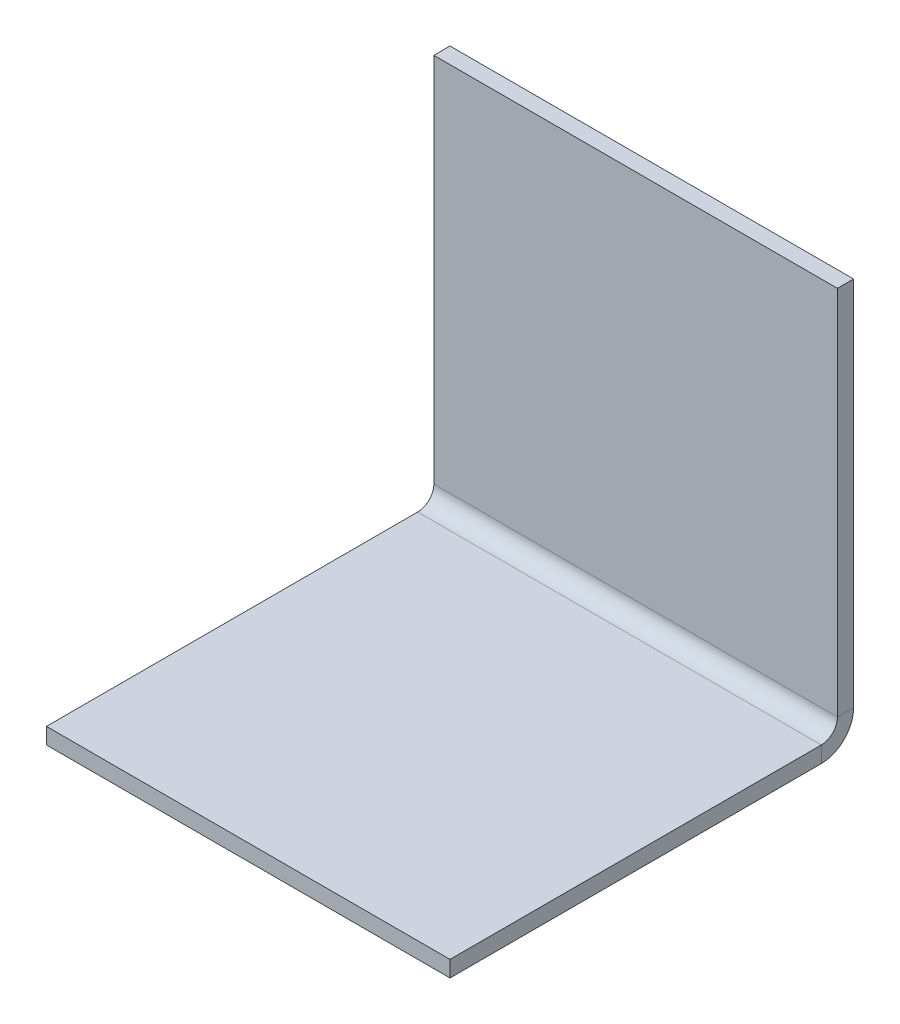
ISO-10303-21;
HEADER;
FILE_DESCRIPTION(('STEP AP214'),'2;1');
FILE_NAME('part.step','',(''),(''),'','','');
FILE_SCHEMA(('AUTOMOTIVE_DESIGN { 1 0 10303 214 1 1 1 1 }'));
ENDSEC;
DATA;
#1=APPLICATION_CONTEXT('core data for automotive mechanical design processes');
#2=APPLICATION_PROTOCOL_DEFINITION('international standard','automotive_design',2000,#1);
#3=PRODUCT_CONTEXT('',#1,'mechanical');
#4=PRODUCT('Part','Part','',(#3));
#5=PRODUCT_RELATED_PRODUCT_CATEGORY('part','',(#4));
#6=PRODUCT_DEFINITION_FORMATION('','',#4);
#7=PRODUCT_DEFINITION_CONTEXT('part definition',#1,'design');
#8=PRODUCT_DEFINITION('design','',#6,#7);
#9=PRODUCT_DEFINITION_SHAPE('','',#8);
#10=(LENGTH_UNIT() NAMED_UNIT(*) SI_UNIT(.MILLI.,.METRE.));
#11=(NAMED_UNIT(*) PLANE_ANGLE_UNIT() SI_UNIT($,.RADIAN.));
#12=(NAMED_UNIT(*) SI_UNIT($,.STERADIAN.) SOLID_ANGLE_UNIT());
#13=UNCERTAINTY_MEASURE_WITH_UNIT(LENGTH_MEASURE(1.E-05),#10,'distance_accuracy_value','');
#14=(GEOMETRIC_REPRESENTATION_CONTEXT(3) GLOBAL_UNCERTAINTY_ASSIGNED_CONTEXT((#13)) GLOBAL_UNIT_ASSIGNED_CONTEXT((#10,
#11,#12)) REPRESENTATION_CONTEXT('',''));
#15=CARTESIAN_POINT('',(0.,0.,0.));
#16=DIRECTION('',(0.,0.,1.));
#17=DIRECTION('',(1.,0.,0.));
#18=AXIS2_PLACEMENT_3D('',#15,#16,#17);
#19=CARTESIAN_POINT('',(0.,1.524,1.524));
#20=DIRECTION('',(1.,0.,0.));
#21=DIRECTION('',(0.,0.,1.));
#22=AXIS2_PLACEMENT_3D('',#19,#20,#21);
#23=PLANE('',#22);
#24=DIRECTION('',(0.,1.,0.));
#25=VECTOR('',#24,1.);
#26=CARTESIAN_POINT('',(0.,1.524,3.048));
#27=LINE('',#26,#25);
#28=CARTESIAN_POINT('',(0.,0.,3.048));
#29=VERTEX_POINT('',#28);
#30=CARTESIAN_POINT('',(0.,1.524,3.048));
#31=VERTEX_POINT('',#30);
#32=EDGE_CURVE('E11',#29,#31,#27,.T.);
#33=ORIENTED_EDGE('',*,*,#32,.F.);
#34=DIRECTION('',(0.,0.,-1.));
#35=VECTOR('',#34,1.);
#36=CARTESIAN_POINT('',(0.,0.,1.524));
#37=LINE('',#36,#35);
#38=CARTESIAN_POINT('',(0.,0.,38.1));
#39=VERTEX_POINT('',#38);
#40=EDGE_CURVE('E89',#29,#39,#37,.F.);
#41=ORIENTED_EDGE('',*,*,#40,.T.);
#42=DIRECTION('',(0.,1.,0.));
#43=VECTOR('',#42,1.);
#44=CARTESIAN_POINT('',(0.,1.52399999999999,38.1));
#45=LINE('',#44,#43);
#46=CARTESIAN_POINT('',(0.,1.52399999999999,38.1));
#47=VERTEX_POINT('',#46);
#48=EDGE_CURVE('E49',#39,#47,#45,.T.);
#49=ORIENTED_EDGE('',*,*,#48,.T.);
#50=DIRECTION('',(0.,0.,1.));
#51=VECTOR('',#50,1.);
#52=CARTESIAN_POINT('',(0.,1.524,1.524));
#53=LINE('',#52,#51);
#54=EDGE_CURVE('E92',#31,#47,#53,.T.);
#55=ORIENTED_EDGE('',*,*,#54,.F.);
#56=EDGE_LOOP('',(#33,#41,#49,#55));
#57=FACE_BOUND('',#56,.T.);
#58=ADVANCED_FACE('F39',(#57),#23,.F.);
#59=CARTESIAN_POINT('',(38.1,1.52399999999999,38.1));
#60=DIRECTION('',(0.,0.,1.));
#61=DIRECTION('',(-1.,0.,0.));
#62=AXIS2_PLACEMENT_3D('',#59,#60,#61);
#63=PLANE('',#62);
#64=ORIENTED_EDGE('',*,*,#48,.F.);
#65=DIRECTION('',(1.,0.,0.));
#66=VECTOR('',#65,1.);
#67=CARTESIAN_POINT('',(38.1,0.,38.1));
#68=LINE('',#67,#66);
#69=CARTESIAN_POINT('',(38.1,0.,38.1));
#70=VERTEX_POINT('',#69);
#71=EDGE_CURVE('E117',#70,#39,#68,.F.);
#72=ORIENTED_EDGE('',*,*,#71,.F.);
#73=DIRECTION('',(0.,1.,0.));
#74=VECTOR('',#73,1.);
#75=CARTESIAN_POINT('',(38.1,1.52399999999999,38.1));
#76=LINE('',#75,#74);
#77=CARTESIAN_POINT('',(38.1,1.52399999999999,38.1));
#78=VERTEX_POINT('',#77);
#79=EDGE_CURVE('E135',#70,#78,#76,.T.);
#80=ORIENTED_EDGE('',*,*,#79,.T.);
#81=DIRECTION('',(-1.,0.,0.));
#82=VECTOR('',#81,1.);
#83=CARTESIAN_POINT('',(38.1,1.52399999999999,38.1));
#84=LINE('',#83,#82);
#85=EDGE_CURVE('E146',#78,#47,#84,.T.);
#86=ORIENTED_EDGE('',*,*,#85,.T.);
#87=EDGE_LOOP('',(#64,#72,#80,#86));
#88=FACE_BOUND('',#87,.T.);
#89=ADVANCED_FACE('F152',(#88),#63,.T.);
#90=CARTESIAN_POINT('',(38.1,1.524,1.524));
#91=DIRECTION('',(1.,0.,0.));
#92=DIRECTION('',(0.,0.,1.));
#93=AXIS2_PLACEMENT_3D('',#90,#91,#92);
#94=PLANE('',#93);
#95=ORIENTED_EDGE('',*,*,#79,.F.);
#96=DIRECTION('',(0.,0.,-1.));
#97=VECTOR('',#96,1.);
#98=CARTESIAN_POINT('',(38.1,0.,1.524));
#99=LINE('',#98,#97);
#100=CARTESIAN_POINT('',(38.1,0.,3.048));
#101=VERTEX_POINT('',#100);
#102=EDGE_CURVE('E177',#101,#70,#99,.F.);
#103=ORIENTED_EDGE('',*,*,#102,.F.);
#104=DIRECTION('',(0.,1.,0.));
#105=VECTOR('',#104,1.);
#106=CARTESIAN_POINT('',(38.1,1.524,3.048));
#107=LINE('',#106,#105);
#108=CARTESIAN_POINT('',(38.1,1.524,3.048));
#109=VERTEX_POINT('',#108);
#110=EDGE_CURVE('E132',#101,#109,#107,.T.);
#111=ORIENTED_EDGE('',*,*,#110,.T.);
#112=DIRECTION('',(0.,0.,1.));
#113=VECTOR('',#112,1.);
#114=CARTESIAN_POINT('',(38.1,1.524,1.524));
#115=LINE('',#114,#113);
#116=EDGE_CURVE('E153',#109,#78,#115,.T.);
#117=ORIENTED_EDGE('',*,*,#116,.T.);
#118=EDGE_LOOP('',(#95,#103,#111,#117));
#119=FACE_BOUND('',#118,.T.);
#120=ADVANCED_FACE('F183',(#119),#94,.T.);
#121=CARTESIAN_POINT('',(38.1,3.048,3.048));
#122=DIRECTION('',(1.,0.,0.));
#123=DIRECTION('',(0.,0.,-1.));
#124=AXIS2_PLACEMENT_3D('',#121,#122,#123);
#125=PLANE('',#124);
#126=ORIENTED_EDGE('',*,*,#110,.F.);
#127=CARTESIAN_POINT('',(38.1,3.048,3.048));
#128=DIRECTION('',(1.,0.,0.));
#129=DIRECTION('',(0.,0.,-1.));
#130=AXIS2_PLACEMENT_3D('',#127,#128,#129);
#131=CIRCLE('',#130,3.048);
#132=CARTESIAN_POINT('',(38.1,3.048,0.));
#133=VERTEX_POINT('',#132);
#134=EDGE_CURVE('E107',#101,#133,#131,.T.);
#135=ORIENTED_EDGE('',*,*,#134,.T.);
#136=DIRECTION('',(0.,0.,1.));
#137=VECTOR('',#136,1.);
#138=CARTESIAN_POINT('',(38.1,3.048,1.524));
#139=LINE('',#138,#137);
#140=CARTESIAN_POINT('',(38.1,3.048,1.524));
#141=VERTEX_POINT('',#140);
#142=EDGE_CURVE('E57',#133,#141,#139,.T.);
#143=ORIENTED_EDGE('',*,*,#142,.T.);
#144=CARTESIAN_POINT('',(38.1,3.048,3.048));
#145=DIRECTION('',(-1.,0.,0.));
#146=DIRECTION('',(0.,0.,1.));
#147=AXIS2_PLACEMENT_3D('',#144,#145,#146);
#148=CIRCLE('',#147,1.524);
#149=EDGE_CURVE('E150',#109,#141,#148,.F.);
#150=ORIENTED_EDGE('',*,*,#149,.F.);
#151=EDGE_LOOP('',(#126,#135,#143,#150));
#152=FACE_BOUND('',#151,.T.);
#153=ADVANCED_FACE('F186',(#152),#125,.T.);
#154=CARTESIAN_POINT('',(38.1,38.1,1.524));
#155=DIRECTION('',(1.,0.,0.));
#156=DIRECTION('',(0.,-1.,0.));
#157=AXIS2_PLACEMENT_3D('',#154,#155,#156);
#158=PLANE('',#157);
#159=ORIENTED_EDGE('',*,*,#142,.F.);
#160=DIRECTION('',(0.,1.,0.));
#161=VECTOR('',#160,1.);
#162=CARTESIAN_POINT('',(38.1,38.1,0.));
#163=LINE('',#162,#161);
#164=CARTESIAN_POINT('',(38.1,38.1,0.));
#165=VERTEX_POINT('',#164);
#166=EDGE_CURVE('E176',#165,#133,#163,.F.);
#167=ORIENTED_EDGE('',*,*,#166,.F.);
#168=DIRECTION('',(0.,0.,1.));
#169=VECTOR('',#168,1.);
#170=CARTESIAN_POINT('',(38.1,38.1,1.524));
#171=LINE('',#170,#169);
#172=CARTESIAN_POINT('',(38.1,38.1,1.524));
#173=VERTEX_POINT('',#172);
#174=EDGE_CURVE('E128',#165,#173,#171,.T.);
#175=ORIENTED_EDGE('',*,*,#174,.T.);
#176=DIRECTION('',(0.,-1.,0.));
#177=VECTOR('',#176,1.);
#178=CARTESIAN_POINT('',(38.1,38.1,1.524));
#179=LINE('',#178,#177);
#180=EDGE_CURVE('E160',#173,#141,#179,.T.);
#181=ORIENTED_EDGE('',*,*,#180,.T.);
#182=EDGE_LOOP('',(#159,#167,#175,#181));
#183=FACE_BOUND('',#182,.T.);
#184=ADVANCED_FACE('F197',(#183),#158,.T.);
#185=CARTESIAN_POINT('',(38.1,38.1,1.524));
#186=DIRECTION('',(0.,-1.,0.));
#187=DIRECTION('',(-1.,0.,0.));
#188=AXIS2_PLACEMENT_3D('',#185,#186,#187);
#189=PLANE('',#188);
#190=ORIENTED_EDGE('',*,*,#174,.F.);
#191=DIRECTION('',(1.,0.,0.));
#192=VECTOR('',#191,1.);
#193=CARTESIAN_POINT('',(38.1,38.1,0.));
#194=LINE('',#193,#192);
#195=CARTESIAN_POINT('',(0.,38.1,0.));
#196=VERTEX_POINT('',#195);
#197=EDGE_CURVE('E112',#165,#196,#194,.F.);
#198=ORIENTED_EDGE('',*,*,#197,.T.);
#199=DIRECTION('',(0.,0.,1.));
#200=VECTOR('',#199,1.);
#201=CARTESIAN_POINT('',(0.,38.1,1.524));
#202=LINE('',#201,#200);
#203=CARTESIAN_POINT('',(0.,38.1,1.524));
#204=VERTEX_POINT('',#203);
#205=EDGE_CURVE('E125',#196,#204,#202,.T.);
#206=ORIENTED_EDGE('',*,*,#205,.T.);
#207=DIRECTION('',(-1.,0.,0.));
#208=VECTOR('',#207,1.);
#209=CARTESIAN_POINT('',(38.1,38.1,1.524));
#210=LINE('',#209,#208);
#211=EDGE_CURVE('E163',#173,#204,#210,.T.);
#212=ORIENTED_EDGE('',*,*,#211,.F.);
#213=EDGE_LOOP('',(#190,#198,#206,#212));
#214=FACE_BOUND('',#213,.T.);
#215=ADVANCED_FACE('F203',(#214),#189,.F.);
#216=CARTESIAN_POINT('',(0.,38.1,1.524));
#217=DIRECTION('',(1.,0.,0.));
#218=DIRECTION('',(0.,-1.,0.));
#219=AXIS2_PLACEMENT_3D('',#216,#217,#218);
#220=PLANE('',#219);
#221=ORIENTED_EDGE('',*,*,#205,.F.);
#222=DIRECTION('',(0.,1.,0.));
#223=VECTOR('',#222,1.);
#224=CARTESIAN_POINT('',(0.,38.1,0.));
#225=LINE('',#224,#223);
#226=CARTESIAN_POINT('',(0.,3.048,0.));
#227=VERTEX_POINT('',#226);
#228=EDGE_CURVE('E174',#196,#227,#225,.F.);
#229=ORIENTED_EDGE('',*,*,#228,.T.);
#230=DIRECTION('',(0.,0.,1.));
#231=VECTOR('',#230,1.);
#232=CARTESIAN_POINT('',(0.,3.048,1.524));
#233=LINE('',#232,#231);
#234=CARTESIAN_POINT('',(0.,3.048,1.524));
#235=VERTEX_POINT('',#234);
#236=EDGE_CURVE('E43',#227,#235,#233,.T.);
#237=ORIENTED_EDGE('',*,*,#236,.T.);
#238=DIRECTION('',(0.,-1.,0.));
#239=VECTOR('',#238,1.);
#240=CARTESIAN_POINT('',(0.,38.1,1.524));
#241=LINE('',#240,#239);
#242=EDGE_CURVE('E155',#204,#235,#241,.T.);
#243=ORIENTED_EDGE('',*,*,#242,.F.);
#244=EDGE_LOOP('',(#221,#229,#237,#243));
#245=FACE_BOUND('',#244,.T.);
#246=ADVANCED_FACE('F207',(#245),#220,.F.);
#247=CARTESIAN_POINT('',(0.,3.048,3.048));
#248=DIRECTION('',(-1.,0.,0.));
#249=DIRECTION('',(0.,0.,1.));
#250=AXIS2_PLACEMENT_3D('',#247,#248,#249);
#251=PLANE('',#250);
#252=CARTESIAN_POINT('',(0.,3.048,3.048));
#253=DIRECTION('',(1.,0.,0.));
#254=DIRECTION('',(0.,0.,-1.));
#255=AXIS2_PLACEMENT_3D('',#252,#253,#254);
#256=CIRCLE('',#255,3.048);
#257=EDGE_CURVE('E105',#227,#29,#256,.F.);
#258=ORIENTED_EDGE('',*,*,#257,.T.);
#259=ORIENTED_EDGE('',*,*,#32,.T.);
#260=CARTESIAN_POINT('',(0.,3.048,3.048));
#261=DIRECTION('',(1.,0.,0.));
#262=DIRECTION('',(0.,0.,-1.));
#263=AXIS2_PLACEMENT_3D('',#260,#261,#262);
#264=CIRCLE('',#263,1.524);
#265=EDGE_CURVE('E170',#235,#31,#264,.F.);
#266=ORIENTED_EDGE('',*,*,#265,.F.);
#267=ORIENTED_EDGE('',*,*,#236,.F.);
#268=EDGE_LOOP('',(#258,#259,#266,#267));
#269=FACE_BOUND('',#268,.T.);
#270=ADVANCED_FACE('F41',(#269),#251,.T.);
#271=CARTESIAN_POINT('',(38.1,38.1,1.524));
#272=DIRECTION('',(0.,0.,-1.));
#273=DIRECTION('',(0.,1.,0.));
#274=AXIS2_PLACEMENT_3D('',#271,#272,#273);
#275=PLANE('',#274);
#276=ORIENTED_EDGE('',*,*,#242,.T.);
#277=DIRECTION('',(-1.,0.,0.));
#278=VECTOR('',#277,1.);
#279=CARTESIAN_POINT('',(38.1,3.048,1.524));
#280=LINE('',#279,#278);
#281=EDGE_CURVE('E167',#235,#141,#280,.F.);
#282=ORIENTED_EDGE('',*,*,#281,.T.);
#283=ORIENTED_EDGE('',*,*,#180,.F.);
#284=ORIENTED_EDGE('',*,*,#211,.T.);
#285=EDGE_LOOP('',(#276,#282,#283,#284));
#286=FACE_BOUND('',#285,.T.);
#287=ADVANCED_FACE('F202',(#286),#275,.F.);
#288=CARTESIAN_POINT('',(38.1,1.524,1.524));
#289=DIRECTION('',(0.,-1.,0.));
#290=DIRECTION('',(0.,0.,-1.));
#291=AXIS2_PLACEMENT_3D('',#288,#289,#290);
#292=PLANE('',#291);
#293=ORIENTED_EDGE('',*,*,#116,.F.);
#294=DIRECTION('',(-1.,0.,0.));
#295=VECTOR('',#294,1.);
#296=CARTESIAN_POINT('',(0.,1.524,3.048));
#297=LINE('',#296,#295);
#298=EDGE_CURVE('E149',#109,#31,#297,.T.);
#299=ORIENTED_EDGE('',*,*,#298,.T.);
#300=ORIENTED_EDGE('',*,*,#54,.T.);
#301=ORIENTED_EDGE('',*,*,#85,.F.);
#302=EDGE_LOOP('',(#293,#299,#300,#301));
#303=FACE_BOUND('',#302,.T.);
#304=ADVANCED_FACE('F145',(#303),#292,.F.);
#305=CARTESIAN_POINT('',(38.1,3.048,3.048));
#306=DIRECTION('',(1.,0.,0.));
#307=DIRECTION('',(0.,0.,-1.));
#308=AXIS2_PLACEMENT_3D('',#305,#306,#307);
#309=CYLINDRICAL_SURFACE('',#308,1.524);
#310=ORIENTED_EDGE('',*,*,#149,.T.);
#311=ORIENTED_EDGE('',*,*,#281,.F.);
#312=ORIENTED_EDGE('',*,*,#265,.T.);
#313=ORIENTED_EDGE('',*,*,#298,.F.);
#314=EDGE_LOOP('',(#310,#311,#312,#313));
#315=FACE_BOUND('',#314,.T.);
#316=ADVANCED_FACE('F189',(#315),#309,.F.);
#317=CARTESIAN_POINT('',(38.1,38.1,0.));
#318=DIRECTION('',(0.,0.,-1.));
#319=DIRECTION('',(0.,1.,0.));
#320=AXIS2_PLACEMENT_3D('',#317,#318,#319);
#321=PLANE('',#320);
#322=ORIENTED_EDGE('',*,*,#228,.F.);
#323=ORIENTED_EDGE('',*,*,#197,.F.);
#324=ORIENTED_EDGE('',*,*,#166,.T.);
#325=DIRECTION('',(1.,0.,0.));
#326=VECTOR('',#325,1.);
#327=CARTESIAN_POINT('',(38.1,3.048,0.));
#328=LINE('',#327,#326);
#329=EDGE_CURVE('E111',#227,#133,#328,.T.);
#330=ORIENTED_EDGE('',*,*,#329,.F.);
#331=EDGE_LOOP('',(#322,#323,#324,#330));
#332=FACE_BOUND('',#331,.T.);
#333=ADVANCED_FACE('F209',(#332),#321,.T.);
#334=CARTESIAN_POINT('',(38.1,0.,1.524));
#335=DIRECTION('',(0.,-1.,0.));
#336=DIRECTION('',(0.,0.,-1.));
#337=AXIS2_PLACEMENT_3D('',#334,#335,#336);
#338=PLANE('',#337);
#339=ORIENTED_EDGE('',*,*,#102,.T.);
#340=ORIENTED_EDGE('',*,*,#71,.T.);
#341=ORIENTED_EDGE('',*,*,#40,.F.);
#342=DIRECTION('',(1.,0.,0.));
#343=VECTOR('',#342,1.);
#344=CARTESIAN_POINT('',(38.1,0.,3.048));
#345=LINE('',#344,#343);
#346=EDGE_CURVE('E102',#101,#29,#345,.F.);
#347=ORIENTED_EDGE('',*,*,#346,.F.);
#348=EDGE_LOOP('',(#339,#340,#341,#347));
#349=FACE_BOUND('',#348,.T.);
#350=ADVANCED_FACE('F115',(#349),#338,.T.);
#351=CARTESIAN_POINT('',(38.1,3.048,3.048));
#352=DIRECTION('',(1.,0.,0.));
#353=DIRECTION('',(0.,0.,-1.));
#354=AXIS2_PLACEMENT_3D('',#351,#352,#353);
#355=CYLINDRICAL_SURFACE('',#354,3.048);
#356=ORIENTED_EDGE('',*,*,#134,.F.);
#357=ORIENTED_EDGE('',*,*,#346,.T.);
#358=ORIENTED_EDGE('',*,*,#257,.F.);
#359=ORIENTED_EDGE('',*,*,#329,.T.);
#360=EDGE_LOOP('',(#356,#357,#358,#359));
#361=FACE_BOUND('',#360,.T.);
#362=ADVANCED_FACE('F103',(#361),#355,.T.);
#363=CLOSED_SHELL('',(#58,#89,#120,#153,#184,#215,#246,#270,#287,#304,#316,#333,#350,#362));
#364=MANIFOLD_SOLID_BREP('B2',#363);
#365=ADVANCED_BREP_SHAPE_REPRESENTATION('',(#18,#364),#14);
#366=SHAPE_DEFINITION_REPRESENTATION(#9,#365);
ENDSEC;
END-ISO-10303-21;
